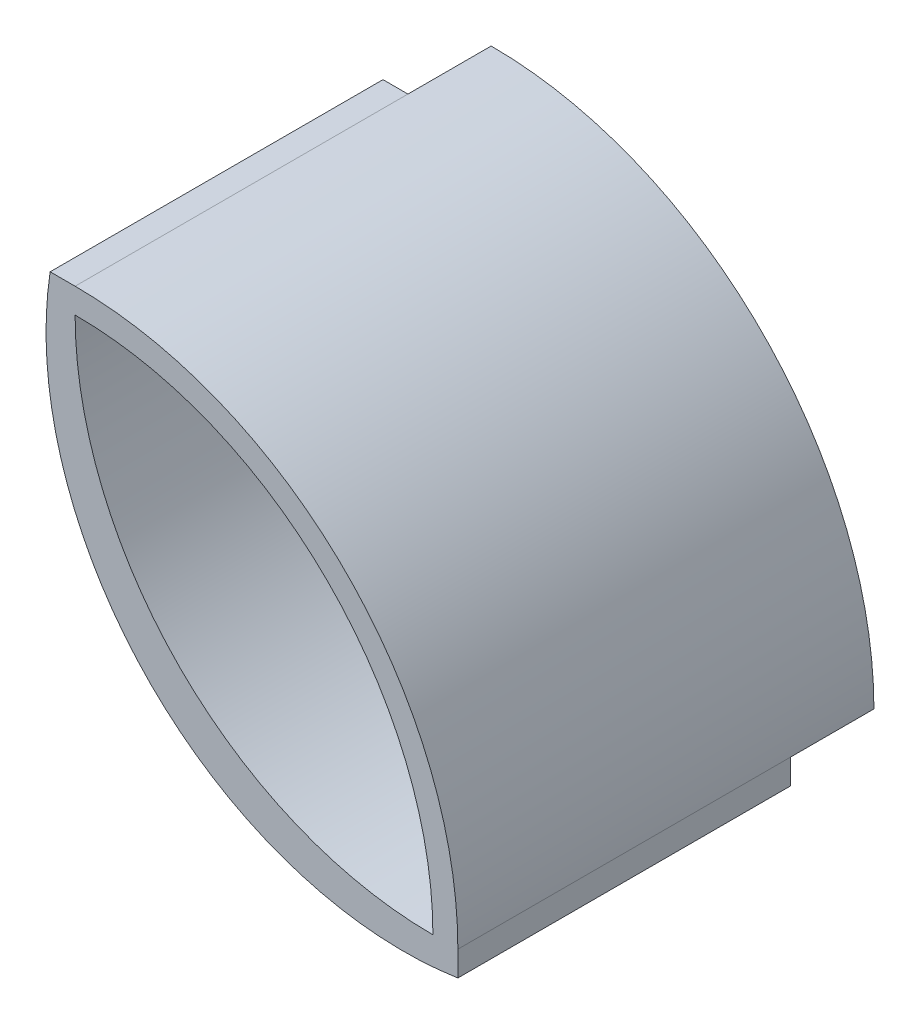
ISO-10303-21;
HEADER;
FILE_DESCRIPTION(('STEP AP214'),'2;1');
FILE_NAME('part.step','',(''),(''),'','','');
FILE_SCHEMA(('AUTOMOTIVE_DESIGN { 1 0 10303 214 1 1 1 1 }'));
ENDSEC;
DATA;
#1=APPLICATION_CONTEXT('core data for automotive mechanical design processes');
#2=APPLICATION_PROTOCOL_DEFINITION('international standard','automotive_design',2000,#1);
#3=PRODUCT_CONTEXT('',#1,'mechanical');
#4=PRODUCT('Part','Part','',(#3));
#5=PRODUCT_RELATED_PRODUCT_CATEGORY('part','',(#4));
#6=PRODUCT_DEFINITION_FORMATION('','',#4);
#7=PRODUCT_DEFINITION_CONTEXT('part definition',#1,'design');
#8=PRODUCT_DEFINITION('design','',#6,#7);
#9=PRODUCT_DEFINITION_SHAPE('','',#8);
#10=(LENGTH_UNIT() NAMED_UNIT(*) SI_UNIT(.MILLI.,.METRE.));
#11=(NAMED_UNIT(*) PLANE_ANGLE_UNIT() SI_UNIT($,.RADIAN.));
#12=(NAMED_UNIT(*) SI_UNIT($,.STERADIAN.) SOLID_ANGLE_UNIT());
#13=UNCERTAINTY_MEASURE_WITH_UNIT(LENGTH_MEASURE(1.E-05),#10,'distance_accuracy_value','');
#14=(GEOMETRIC_REPRESENTATION_CONTEXT(3) GLOBAL_UNCERTAINTY_ASSIGNED_CONTEXT((#13)) GLOBAL_UNIT_ASSIGNED_CONTEXT((#10,
#11,#12)) REPRESENTATION_CONTEXT('',''));
#15=CARTESIAN_POINT('',(0.,0.,0.));
#16=DIRECTION('',(0.,0.,1.));
#17=DIRECTION('',(1.,0.,0.));
#18=AXIS2_PLACEMENT_3D('',#15,#16,#17);
#19=CARTESIAN_POINT('',(0.,46.,10.));
#20=DIRECTION('',(1.,0.,0.));
#21=DIRECTION('',(0.,0.,-1.));
#22=AXIS2_PLACEMENT_3D('',#19,#20,#21);
#23=PLANE('',#22);
#24=DIRECTION('',(0.,1.,0.));
#25=VECTOR('',#24,1.);
#26=CARTESIAN_POINT('',(0.,46.,10.));
#27=LINE('',#26,#25);
#28=CARTESIAN_POINT('',(0.,43.,10.));
#29=VERTEX_POINT('',#28);
#30=CARTESIAN_POINT('',(0.,46.,10.));
#31=VERTEX_POINT('',#30);
#32=EDGE_CURVE('E177',#29,#31,#27,.T.);
#33=ORIENTED_EDGE('',*,*,#32,.T.);
#34=DIRECTION('',(0.,0.,-1.));
#35=VECTOR('',#34,1.);
#36=CARTESIAN_POINT('',(0.,46.,10.));
#37=LINE('',#36,#35);
#38=CARTESIAN_POINT('',(0.,46.,0.));
#39=VERTEX_POINT('',#38);
#40=EDGE_CURVE('E41',#31,#39,#37,.T.);
#41=ORIENTED_EDGE('',*,*,#40,.T.);
#42=DIRECTION('',(0.,-1.,0.));
#43=VECTOR('',#42,1.);
#44=CARTESIAN_POINT('',(0.,46.,0.));
#45=LINE('',#44,#43);
#46=CARTESIAN_POINT('',(0.,43.,0.));
#47=VERTEX_POINT('',#46);
#48=EDGE_CURVE('E121',#39,#47,#45,.T.);
#49=ORIENTED_EDGE('',*,*,#48,.T.);
#50=DIRECTION('',(0.,0.,-1.));
#51=VECTOR('',#50,1.);
#52=CARTESIAN_POINT('',(0.,43.,10.));
#53=LINE('',#52,#51);
#54=EDGE_CURVE('E136',#29,#47,#53,.T.);
#55=ORIENTED_EDGE('',*,*,#54,.F.);
#56=EDGE_LOOP('',(#33,#41,#49,#55));
#57=FACE_BOUND('',#56,.T.);
#58=ADVANCED_FACE('F33',(#57),#23,.F.);
#59=CARTESIAN_POINT('',(43.,0.,10.));
#60=DIRECTION('',(0.,1.,0.));
#61=DIRECTION('',(0.,0.,1.));
#62=AXIS2_PLACEMENT_3D('',#59,#60,#61);
#63=PLANE('',#62);
#64=DIRECTION('',(-1.,0.,0.));
#65=VECTOR('',#64,1.);
#66=CARTESIAN_POINT('',(46.,0.,10.));
#67=LINE('',#66,#65);
#68=CARTESIAN_POINT('',(46.,0.,10.));
#69=VERTEX_POINT('',#68);
#70=CARTESIAN_POINT('',(43.,0.,10.));
#71=VERTEX_POINT('',#70);
#72=EDGE_CURVE('E153',#69,#71,#67,.T.);
#73=ORIENTED_EDGE('',*,*,#72,.T.);
#74=DIRECTION('',(0.,0.,-1.));
#75=VECTOR('',#74,1.);
#76=CARTESIAN_POINT('',(43.,0.,10.));
#77=LINE('',#76,#75);
#78=CARTESIAN_POINT('',(43.,0.,0.));
#79=VERTEX_POINT('',#78);
#80=EDGE_CURVE('E55',#71,#79,#77,.T.);
#81=ORIENTED_EDGE('',*,*,#80,.T.);
#82=DIRECTION('',(1.,0.,0.));
#83=VECTOR('',#82,1.);
#84=CARTESIAN_POINT('',(43.,0.,0.));
#85=LINE('',#84,#83);
#86=CARTESIAN_POINT('',(46.,0.,0.));
#87=VERTEX_POINT('',#86);
#88=EDGE_CURVE('E131',#79,#87,#85,.T.);
#89=ORIENTED_EDGE('',*,*,#88,.T.);
#90=DIRECTION('',(0.,0.,-1.));
#91=VECTOR('',#90,1.);
#92=CARTESIAN_POINT('',(46.,0.,10.));
#93=LINE('',#92,#91);
#94=EDGE_CURVE('E48',#69,#87,#93,.T.);
#95=ORIENTED_EDGE('',*,*,#94,.F.);
#96=EDGE_LOOP('',(#73,#81,#89,#95));
#97=FACE_BOUND('',#96,.T.);
#98=ADVANCED_FACE('F151',(#97),#63,.F.);
#99=CARTESIAN_POINT('',(0.,0.,10.));
#100=DIRECTION('',(0.,0.,-1.));
#101=DIRECTION('',(-1.,0.,0.));
#102=AXIS2_PLACEMENT_3D('',#99,#100,#101);
#103=CYLINDRICAL_SURFACE('',#102,46.);
#104=CARTESIAN_POINT('',(0.,0.,0.));
#105=DIRECTION('',(0.,0.,1.));
#106=DIRECTION('',(1.,0.,0.));
#107=AXIS2_PLACEMENT_3D('',#104,#105,#106);
#108=CIRCLE('',#107,46.);
#109=EDGE_CURVE('E118',#87,#39,#108,.T.);
#110=ORIENTED_EDGE('',*,*,#109,.T.);
#111=ORIENTED_EDGE('',*,*,#40,.F.);
#112=CARTESIAN_POINT('',(0.,46.,50.));
#113=VERTEX_POINT('',#112);
#114=EDGE_CURVE('E11',#113,#31,#37,.T.);
#115=ORIENTED_EDGE('',*,*,#114,.F.);
#116=CARTESIAN_POINT('',(-4.44089209850063E-13,-4.44089209850063E-13,50.));
#117=DIRECTION('',(0.,0.,1.));
#118=DIRECTION('',(-1.,0.,0.));
#119=AXIS2_PLACEMENT_3D('',#116,#117,#118);
#120=CIRCLE('',#119,46.0000000000004);
#121=CARTESIAN_POINT('',(46.,0.,50.));
#122=VERTEX_POINT('',#121);
#123=EDGE_CURVE('E113',#122,#113,#120,.T.);
#124=ORIENTED_EDGE('',*,*,#123,.F.);
#125=EDGE_CURVE('E133',#122,#69,#93,.T.);
#126=ORIENTED_EDGE('',*,*,#125,.T.);
#127=ORIENTED_EDGE('',*,*,#94,.T.);
#128=EDGE_LOOP('',(#110,#111,#115,#124,#126,#127));
#129=FACE_BOUND('',#128,.T.);
#130=ADVANCED_FACE('F35',(#129),#103,.T.);
#131=CARTESIAN_POINT('',(0.,0.,10.));
#132=DIRECTION('',(0.,0.,-1.));
#133=DIRECTION('',(-1.,0.,0.));
#134=AXIS2_PLACEMENT_3D('',#131,#132,#133);
#135=CYLINDRICAL_SURFACE('',#134,43.);
#136=CARTESIAN_POINT('',(0.,0.,0.));
#137=DIRECTION('',(0.,0.,-1.));
#138=DIRECTION('',(1.,0.,0.));
#139=AXIS2_PLACEMENT_3D('',#136,#137,#138);
#140=CIRCLE('',#139,43.);
#141=EDGE_CURVE('E129',#47,#79,#140,.T.);
#142=ORIENTED_EDGE('',*,*,#141,.T.);
#143=ORIENTED_EDGE('',*,*,#80,.F.);
#144=CARTESIAN_POINT('',(43.,0.,50.));
#145=VERTEX_POINT('',#144);
#146=EDGE_CURVE('E135',#145,#71,#77,.T.);
#147=ORIENTED_EDGE('',*,*,#146,.F.);
#148=CARTESIAN_POINT('',(-1.52655665885959E-13,-1.52655665885959E-13,50.));
#149=DIRECTION('',(0.,0.,-1.));
#150=DIRECTION('',(-1.,0.,0.));
#151=AXIS2_PLACEMENT_3D('',#148,#149,#150);
#152=CIRCLE('',#151,43.0000000000001);
#153=CARTESIAN_POINT('',(0.,43.,50.));
#154=VERTEX_POINT('',#153);
#155=EDGE_CURVE('E119',#154,#145,#152,.T.);
#156=ORIENTED_EDGE('',*,*,#155,.F.);
#157=EDGE_CURVE('E137',#154,#29,#53,.T.);
#158=ORIENTED_EDGE('',*,*,#157,.T.);
#159=ORIENTED_EDGE('',*,*,#54,.T.);
#160=EDGE_LOOP('',(#142,#143,#147,#156,#158,#159));
#161=FACE_BOUND('',#160,.T.);
#162=ADVANCED_FACE('F142',(#161),#135,.F.);
#163=CARTESIAN_POINT('',(0.,0.,0.));
#164=DIRECTION('',(0.,0.,1.));
#165=DIRECTION('',(1.,0.,0.));
#166=AXIS2_PLACEMENT_3D('',#163,#164,#165);
#167=PLANE('',#166);
#168=ORIENTED_EDGE('',*,*,#109,.F.);
#169=ORIENTED_EDGE('',*,*,#88,.F.);
#170=ORIENTED_EDGE('',*,*,#141,.F.);
#171=ORIENTED_EDGE('',*,*,#48,.F.);
#172=EDGE_LOOP('',(#168,#169,#170,#171));
#173=FACE_BOUND('',#172,.T.);
#174=ADVANCED_FACE('F150',(#173),#167,.F.);
#175=CARTESIAN_POINT('',(-1.52655665885959E-13,-1.52655665885959E-13,50.));
#176=DIRECTION('',(0.,0.,-1.));
#177=DIRECTION('',(-1.,0.,0.));
#178=AXIS2_PLACEMENT_3D('',#175,#176,#177);
#179=PLANE('',#178);
#180=CARTESIAN_POINT('',(43.,43.,50.));
#181=DIRECTION('',(0.,0.,-1.));
#182=DIRECTION('',(1.,0.,0.));
#183=AXIS2_PLACEMENT_3D('',#180,#181,#182);
#184=CIRCLE('',#183,43.);
#185=EDGE_CURVE('E109',#145,#154,#184,.T.);
#186=ORIENTED_EDGE('',*,*,#185,.T.);
#187=ORIENTED_EDGE('',*,*,#155,.T.);
#188=EDGE_LOOP('',(#186,#187));
#189=FACE_BOUND('',#188,.T.);
#190=ORIENTED_EDGE('',*,*,#123,.T.);
#191=DIRECTION('',(-1.,0.,0.));
#192=VECTOR('',#191,1.);
#193=CARTESIAN_POINT('',(0.,46.,50.));
#194=LINE('',#193,#192);
#195=CARTESIAN_POINT('',(-3.,46.,50.));
#196=VERTEX_POINT('',#195);
#197=EDGE_CURVE('E99',#113,#196,#194,.T.);
#198=ORIENTED_EDGE('',*,*,#197,.T.);
#199=CARTESIAN_POINT('',(39.5069431053691,39.5069431053691,50.));
#200=DIRECTION('',(0.,0.,1.));
#201=DIRECTION('',(-1.,0.,0.));
#202=AXIS2_PLACEMENT_3D('',#199,#200,#201);
#203=CIRCLE('',#202,43.);
#204=CARTESIAN_POINT('',(46.,-3.,50.));
#205=VERTEX_POINT('',#204);
#206=EDGE_CURVE('E108',#196,#205,#203,.T.);
#207=ORIENTED_EDGE('',*,*,#206,.T.);
#208=DIRECTION('',(0.,1.,0.));
#209=VECTOR('',#208,1.);
#210=CARTESIAN_POINT('',(46.,0.,50.));
#211=LINE('',#210,#209);
#212=EDGE_CURVE('E117',#205,#122,#211,.T.);
#213=ORIENTED_EDGE('',*,*,#212,.T.);
#214=EDGE_LOOP('',(#190,#198,#207,#213));
#215=FACE_BOUND('',#214,.T.);
#216=ADVANCED_FACE('F115',(#189,#215),#179,.F.);
#217=CARTESIAN_POINT('',(43.,43.,50.));
#218=DIRECTION('',(0.,0.,-1.));
#219=DIRECTION('',(-1.,0.,0.));
#220=AXIS2_PLACEMENT_3D('',#217,#218,#219);
#221=CYLINDRICAL_SURFACE('',#220,43.);
#222=CARTESIAN_POINT('',(43.,43.,10.));
#223=DIRECTION('',(0.,0.,-1.));
#224=DIRECTION('',(1.,0.,0.));
#225=AXIS2_PLACEMENT_3D('',#222,#223,#224);
#226=CIRCLE('',#225,43.);
#227=EDGE_CURVE('E168',#71,#29,#226,.T.);
#228=ORIENTED_EDGE('',*,*,#227,.T.);
#229=ORIENTED_EDGE('',*,*,#157,.F.);
#230=ORIENTED_EDGE('',*,*,#185,.F.);
#231=ORIENTED_EDGE('',*,*,#146,.T.);
#232=EDGE_LOOP('',(#228,#229,#230,#231));
#233=FACE_BOUND('',#232,.T.);
#234=ADVANCED_FACE('F184',(#233),#221,.F.);
#235=CARTESIAN_POINT('',(0.,46.,50.));
#236=DIRECTION('',(0.,-1.,0.));
#237=DIRECTION('',(0.,0.,-1.));
#238=AXIS2_PLACEMENT_3D('',#235,#236,#237);
#239=PLANE('',#238);
#240=DIRECTION('',(-1.,0.,0.));
#241=VECTOR('',#240,1.);
#242=CARTESIAN_POINT('',(0.,46.,10.));
#243=LINE('',#242,#241);
#244=CARTESIAN_POINT('',(-3.,46.,10.));
#245=VERTEX_POINT('',#244);
#246=EDGE_CURVE('E176',#31,#245,#243,.T.);
#247=ORIENTED_EDGE('',*,*,#246,.T.);
#248=DIRECTION('',(0.,0.,-1.));
#249=VECTOR('',#248,1.);
#250=CARTESIAN_POINT('',(-3.,46.,50.));
#251=LINE('',#250,#249);
#252=EDGE_CURVE('E104',#196,#245,#251,.T.);
#253=ORIENTED_EDGE('',*,*,#252,.F.);
#254=ORIENTED_EDGE('',*,*,#197,.F.);
#255=ORIENTED_EDGE('',*,*,#114,.T.);
#256=EDGE_LOOP('',(#247,#253,#254,#255));
#257=FACE_BOUND('',#256,.T.);
#258=ADVANCED_FACE('F101',(#257),#239,.F.);
#259=CARTESIAN_POINT('',(39.5069431053691,39.5069431053691,50.));
#260=DIRECTION('',(0.,0.,-1.));
#261=DIRECTION('',(-1.,0.,0.));
#262=AXIS2_PLACEMENT_3D('',#259,#260,#261);
#263=CYLINDRICAL_SURFACE('',#262,43.);
#264=CARTESIAN_POINT('',(39.5069431053691,39.5069431053691,10.));
#265=DIRECTION('',(0.,0.,1.));
#266=DIRECTION('',(-1.,0.,0.));
#267=AXIS2_PLACEMENT_3D('',#264,#265,#266);
#268=CIRCLE('',#267,43.);
#269=CARTESIAN_POINT('',(46.,-3.,10.));
#270=VERTEX_POINT('',#269);
#271=EDGE_CURVE('E163',#245,#270,#268,.T.);
#272=ORIENTED_EDGE('',*,*,#271,.T.);
#273=DIRECTION('',(0.,0.,-1.));
#274=VECTOR('',#273,1.);
#275=CARTESIAN_POINT('',(46.,-3.,50.));
#276=LINE('',#275,#274);
#277=EDGE_CURVE('E160',#205,#270,#276,.T.);
#278=ORIENTED_EDGE('',*,*,#277,.F.);
#279=ORIENTED_EDGE('',*,*,#206,.F.);
#280=ORIENTED_EDGE('',*,*,#252,.T.);
#281=EDGE_LOOP('',(#272,#278,#279,#280));
#282=FACE_BOUND('',#281,.T.);
#283=ADVANCED_FACE('F175',(#282),#263,.T.);
#284=CARTESIAN_POINT('',(46.,0.,50.));
#285=DIRECTION('',(-1.,0.,0.));
#286=DIRECTION('',(0.,0.,1.));
#287=AXIS2_PLACEMENT_3D('',#284,#285,#286);
#288=PLANE('',#287);
#289=DIRECTION('',(0.,1.,0.));
#290=VECTOR('',#289,1.);
#291=CARTESIAN_POINT('',(46.,0.,10.));
#292=LINE('',#291,#290);
#293=EDGE_CURVE('E158',#270,#69,#292,.T.);
#294=ORIENTED_EDGE('',*,*,#293,.T.);
#295=ORIENTED_EDGE('',*,*,#125,.F.);
#296=ORIENTED_EDGE('',*,*,#212,.F.);
#297=ORIENTED_EDGE('',*,*,#277,.T.);
#298=EDGE_LOOP('',(#294,#295,#296,#297));
#299=FACE_BOUND('',#298,.T.);
#300=ADVANCED_FACE('F155',(#299),#288,.F.);
#301=CARTESIAN_POINT('',(43.,43.,10.));
#302=DIRECTION('',(0.,0.,1.));
#303=DIRECTION('',(1.,0.,0.));
#304=AXIS2_PLACEMENT_3D('',#301,#302,#303);
#305=PLANE('',#304);
#306=ORIENTED_EDGE('',*,*,#227,.F.);
#307=ORIENTED_EDGE('',*,*,#72,.F.);
#308=ORIENTED_EDGE('',*,*,#293,.F.);
#309=ORIENTED_EDGE('',*,*,#271,.F.);
#310=ORIENTED_EDGE('',*,*,#246,.F.);
#311=ORIENTED_EDGE('',*,*,#32,.F.);
#312=EDGE_LOOP('',(#306,#307,#308,#309,#310,#311));
#313=FACE_BOUND('',#312,.T.);
#314=ADVANCED_FACE('F166',(#313),#305,.F.);
#315=CLOSED_SHELL('',(#58,#98,#130,#162,#174,#216,#234,#258,#283,#300,#314));
#316=MANIFOLD_SOLID_BREP('B2',#315);
#317=ADVANCED_BREP_SHAPE_REPRESENTATION('',(#18,#316),#14);
#318=SHAPE_DEFINITION_REPRESENTATION(#9,#317);
ENDSEC;
END-ISO-10303-21;
